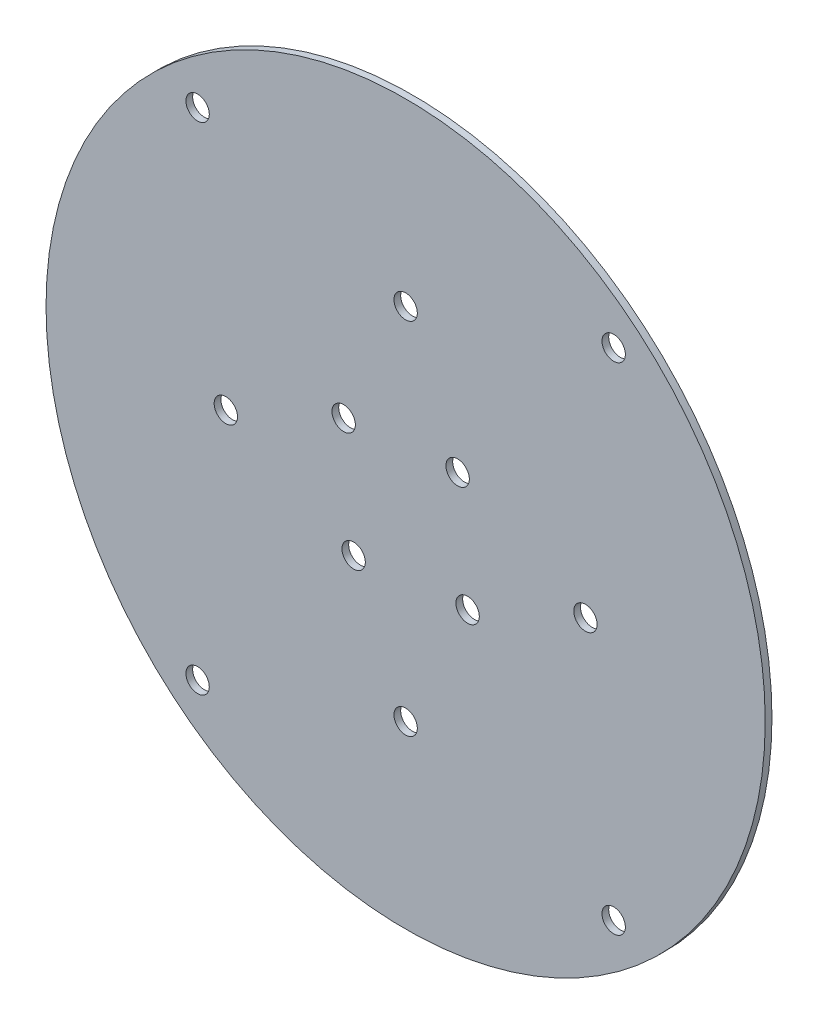
ISO-10303-21;
HEADER;
FILE_DESCRIPTION(('STEP AP214'),'2;1');
FILE_NAME('part.step','',(''),(''),'','','');
FILE_SCHEMA(('AUTOMOTIVE_DESIGN { 1 0 10303 214 1 1 1 1 }'));
ENDSEC;
DATA;
#1=APPLICATION_CONTEXT('core data for automotive mechanical design processes');
#2=APPLICATION_PROTOCOL_DEFINITION('international standard','automotive_design',2000,#1);
#3=PRODUCT_CONTEXT('',#1,'mechanical');
#4=PRODUCT('Part','Part','',(#3));
#5=PRODUCT_RELATED_PRODUCT_CATEGORY('part','',(#4));
#6=PRODUCT_DEFINITION_FORMATION('','',#4);
#7=PRODUCT_DEFINITION_CONTEXT('part definition',#1,'design');
#8=PRODUCT_DEFINITION('design','',#6,#7);
#9=PRODUCT_DEFINITION_SHAPE('','',#8);
#10=(LENGTH_UNIT() NAMED_UNIT(*) SI_UNIT(.MILLI.,.METRE.));
#11=(NAMED_UNIT(*) PLANE_ANGLE_UNIT() SI_UNIT($,.RADIAN.));
#12=(NAMED_UNIT(*) SI_UNIT($,.STERADIAN.) SOLID_ANGLE_UNIT());
#13=UNCERTAINTY_MEASURE_WITH_UNIT(LENGTH_MEASURE(1.E-05),#10,'distance_accuracy_value','');
#14=(GEOMETRIC_REPRESENTATION_CONTEXT(3) GLOBAL_UNCERTAINTY_ASSIGNED_CONTEXT((#13)) GLOBAL_UNIT_ASSIGNED_CONTEXT((#10,
#11,#12)) REPRESENTATION_CONTEXT('',''));
#15=CARTESIAN_POINT('',(0.,0.,0.));
#16=DIRECTION('',(0.,0.,1.));
#17=DIRECTION('',(1.,0.,0.));
#18=AXIS2_PLACEMENT_3D('',#15,#16,#17);
#19=CARTESIAN_POINT('',(0.,0.,1.5));
#20=DIRECTION('',(0.,0.,1.));
#21=DIRECTION('',(1.,0.,0.));
#22=AXIS2_PLACEMENT_3D('',#19,#20,#21);
#23=PLANE('',#22);
#24=CARTESIAN_POINT('',(-13.7887999761416,11.5701769743577,1.5));
#25=DIRECTION('',(0.,0.,1.));
#26=DIRECTION('',(1.,0.,0.));
#27=AXIS2_PLACEMENT_3D('',#24,#25,#26);
#28=CIRCLE('',#27,2.6);
#29=CARTESIAN_POINT('',(-11.1887999761416,11.5701769743577,1.5));
#30=VERTEX_POINT('',#29);
#31=EDGE_CURVE('E103',#30,#30,#28,.T.);
#32=ORIENTED_EDGE('',*,*,#31,.F.);
#33=EDGE_LOOP('',(#32));
#34=FACE_BOUND('',#33,.T.);
#35=CARTESIAN_POINT('',(-11.5701769743577,-13.7887999761416,1.5));
#36=DIRECTION('',(0.,0.,1.));
#37=DIRECTION('',(1.,0.,0.));
#38=AXIS2_PLACEMENT_3D('',#35,#36,#37);
#39=CIRCLE('',#38,2.6);
#40=CARTESIAN_POINT('',(-8.97017697435773,-13.7887999761416,1.5));
#41=VERTEX_POINT('',#40);
#42=EDGE_CURVE('E106',#41,#41,#39,.T.);
#43=ORIENTED_EDGE('',*,*,#42,.F.);
#44=EDGE_LOOP('',(#43));
#45=FACE_BOUND('',#44,.T.);
#46=CARTESIAN_POINT('',(13.7887999761417,-11.5701769743576,1.5));
#47=DIRECTION('',(0.,0.,1.));
#48=DIRECTION('',(1.,0.,0.));
#49=AXIS2_PLACEMENT_3D('',#46,#47,#48);
#50=CIRCLE('',#49,2.6);
#51=CARTESIAN_POINT('',(16.3887999761417,-11.5701769743576,1.5));
#52=VERTEX_POINT('',#51);
#53=EDGE_CURVE('E109',#52,#52,#50,.T.);
#54=ORIENTED_EDGE('',*,*,#53,.F.);
#55=EDGE_LOOP('',(#54));
#56=FACE_BOUND('',#55,.T.);
#57=CARTESIAN_POINT('',(11.5701769743577,13.7887999761416,1.5));
#58=DIRECTION('',(0.,0.,1.));
#59=DIRECTION('',(1.,0.,0.));
#60=AXIS2_PLACEMENT_3D('',#57,#58,#59);
#61=CIRCLE('',#60,2.6);
#62=CARTESIAN_POINT('',(14.1701769743577,13.7887999761416,1.5));
#63=VERTEX_POINT('',#62);
#64=EDGE_CURVE('E95',#63,#63,#61,.T.);
#65=ORIENTED_EDGE('',*,*,#64,.F.);
#66=EDGE_LOOP('',(#65));
#67=FACE_BOUND('',#66,.T.);
#68=CARTESIAN_POINT('',(1.69550539143106E-12,-40.,1.5));
#69=DIRECTION('',(0.,0.,1.));
#70=DIRECTION('',(1.,0.,0.));
#71=AXIS2_PLACEMENT_3D('',#68,#69,#70);
#72=CIRCLE('',#71,2.6);
#73=CARTESIAN_POINT('',(2.6000000000017,-40.,1.5));
#74=VERTEX_POINT('',#73);
#75=EDGE_CURVE('E83',#74,#74,#72,.T.);
#76=ORIENTED_EDGE('',*,*,#75,.F.);
#77=EDGE_LOOP('',(#76));
#78=FACE_BOUND('',#77,.T.);
#79=CARTESIAN_POINT('',(0.,40.,1.5));
#80=DIRECTION('',(0.,0.,1.));
#81=DIRECTION('',(1.,0.,0.));
#82=AXIS2_PLACEMENT_3D('',#79,#80,#81);
#83=CIRCLE('',#82,2.6);
#84=CARTESIAN_POINT('',(2.6,40.,1.5));
#85=VERTEX_POINT('',#84);
#86=EDGE_CURVE('E71',#85,#85,#83,.T.);
#87=ORIENTED_EDGE('',*,*,#86,.F.);
#88=EDGE_LOOP('',(#87));
#89=FACE_BOUND('',#88,.T.);
#90=CARTESIAN_POINT('',(46.280707897431,-55.1551999045663,1.5));
#91=DIRECTION('',(0.,0.,1.));
#92=DIRECTION('',(1.,0.,0.));
#93=AXIS2_PLACEMENT_3D('',#90,#91,#92);
#94=CIRCLE('',#93,2.6);
#95=CARTESIAN_POINT('',(48.880707897431,-55.1551999045663,1.5));
#96=VERTEX_POINT('',#95);
#97=EDGE_CURVE('E59',#96,#96,#94,.T.);
#98=ORIENTED_EDGE('',*,*,#97,.F.);
#99=EDGE_LOOP('',(#98));
#100=FACE_BOUND('',#99,.T.);
#101=CARTESIAN_POINT('',(-46.280707897431,55.1551999045664,1.5));
#102=DIRECTION('',(0.,0.,1.));
#103=DIRECTION('',(1.,0.,0.));
#104=AXIS2_PLACEMENT_3D('',#101,#102,#103);
#105=CIRCLE('',#104,2.6);
#106=CARTESIAN_POINT('',(-43.680707897431,55.1551999045664,1.5));
#107=VERTEX_POINT('',#106);
#108=EDGE_CURVE('E48',#107,#107,#105,.T.);
#109=ORIENTED_EDGE('',*,*,#108,.F.);
#110=EDGE_LOOP('',(#109));
#111=FACE_BOUND('',#110,.T.);
#112=CARTESIAN_POINT('',(0.,0.,1.5));
#113=DIRECTION('',(0.,0.,1.));
#114=DIRECTION('',(1.,0.,0.));
#115=AXIS2_PLACEMENT_3D('',#112,#113,#114);
#116=CIRCLE('',#115,80.);
#117=CARTESIAN_POINT('',(80.,0.,1.5));
#118=VERTEX_POINT('',#117);
#119=EDGE_CURVE('E10',#118,#118,#116,.T.);
#120=ORIENTED_EDGE('',*,*,#119,.T.);
#121=EDGE_LOOP('',(#120));
#122=FACE_BOUND('',#121,.T.);
#123=CARTESIAN_POINT('',(-46.2807078974309,-55.1551999045663,1.5));
#124=DIRECTION('',(0.,0.,1.));
#125=DIRECTION('',(1.,0.,0.));
#126=AXIS2_PLACEMENT_3D('',#123,#124,#125);
#127=CIRCLE('',#126,2.6);
#128=CARTESIAN_POINT('',(-43.6807078974309,-55.1551999045663,1.5));
#129=VERTEX_POINT('',#128);
#130=EDGE_CURVE('E53',#129,#129,#127,.T.);
#131=ORIENTED_EDGE('',*,*,#130,.F.);
#132=EDGE_LOOP('',(#131));
#133=FACE_BOUND('',#132,.T.);
#134=CARTESIAN_POINT('',(46.2807078974309,55.1551999045663,1.5));
#135=DIRECTION('',(0.,0.,1.));
#136=DIRECTION('',(1.,0.,0.));
#137=AXIS2_PLACEMENT_3D('',#134,#135,#136);
#138=CIRCLE('',#137,2.6);
#139=CARTESIAN_POINT('',(48.8807078974309,55.1551999045663,1.5));
#140=VERTEX_POINT('',#139);
#141=EDGE_CURVE('E65',#140,#140,#138,.T.);
#142=ORIENTED_EDGE('',*,*,#141,.F.);
#143=EDGE_LOOP('',(#142));
#144=FACE_BOUND('',#143,.T.);
#145=CARTESIAN_POINT('',(40.0000000000008,8.47752695715531E-13,1.5));
#146=DIRECTION('',(0.,0.,1.));
#147=DIRECTION('',(1.,0.,0.));
#148=AXIS2_PLACEMENT_3D('',#145,#146,#147);
#149=CIRCLE('',#148,2.6);
#150=CARTESIAN_POINT('',(42.6000000000008,8.47752695715531E-13,1.5));
#151=VERTEX_POINT('',#150);
#152=EDGE_CURVE('E77',#151,#151,#149,.T.);
#153=ORIENTED_EDGE('',*,*,#152,.F.);
#154=EDGE_LOOP('',(#153));
#155=FACE_BOUND('',#154,.T.);
#156=CARTESIAN_POINT('',(-39.9999999999992,-8.5265128291212E-13,1.5));
#157=DIRECTION('',(0.,0.,1.));
#158=DIRECTION('',(1.,0.,0.));
#159=AXIS2_PLACEMENT_3D('',#156,#157,#158);
#160=CIRCLE('',#159,2.6);
#161=CARTESIAN_POINT('',(-37.3999999999992,-8.5265128291212E-13,1.5));
#162=VERTEX_POINT('',#161);
#163=EDGE_CURVE('E89',#162,#162,#160,.T.);
#164=ORIENTED_EDGE('',*,*,#163,.F.);
#165=EDGE_LOOP('',(#164));
#166=FACE_BOUND('',#165,.T.);
#167=ADVANCED_FACE('F37',(#34,#45,#56,#67,#78,#89,#100,#111,#122,#133,#144,#155,#166),#23,.T.);
#168=CARTESIAN_POINT('',(0.,0.,0.));
#169=DIRECTION('',(0.,0.,1.));
#170=DIRECTION('',(1.,0.,0.));
#171=AXIS2_PLACEMENT_3D('',#168,#169,#170);
#172=PLANE('',#171);
#173=CARTESIAN_POINT('',(-13.7887999761416,11.5701769743577,0.));
#174=DIRECTION('',(0.,0.,-1.));
#175=DIRECTION('',(0.,-1.,0.));
#176=AXIS2_PLACEMENT_3D('',#173,#174,#175);
#177=CIRCLE('',#176,2.6);
#178=CARTESIAN_POINT('',(-13.7887999761416,8.97017697435768,0.));
#179=VERTEX_POINT('',#178);
#180=EDGE_CURVE('E112',#179,#179,#177,.T.);
#181=ORIENTED_EDGE('',*,*,#180,.F.);
#182=EDGE_LOOP('',(#181));
#183=FACE_BOUND('',#182,.T.);
#184=CARTESIAN_POINT('',(-11.5701769743577,-13.7887999761416,0.));
#185=DIRECTION('',(0.,0.,-1.));
#186=DIRECTION('',(1.,0.,0.));
#187=AXIS2_PLACEMENT_3D('',#184,#185,#186);
#188=CIRCLE('',#187,2.6);
#189=CARTESIAN_POINT('',(-8.97017697435773,-13.7887999761416,0.));
#190=VERTEX_POINT('',#189);
#191=EDGE_CURVE('E116',#190,#190,#188,.T.);
#192=ORIENTED_EDGE('',*,*,#191,.F.);
#193=EDGE_LOOP('',(#192));
#194=FACE_BOUND('',#193,.T.);
#195=CARTESIAN_POINT('',(13.7887999761417,-11.5701769743576,0.));
#196=DIRECTION('',(0.,0.,-1.));
#197=DIRECTION('',(0.,1.,0.));
#198=AXIS2_PLACEMENT_3D('',#195,#196,#197);
#199=CIRCLE('',#198,2.6);
#200=CARTESIAN_POINT('',(13.7887999761417,-8.97017697435758,0.));
#201=VERTEX_POINT('',#200);
#202=EDGE_CURVE('E113',#201,#201,#199,.T.);
#203=ORIENTED_EDGE('',*,*,#202,.F.);
#204=EDGE_LOOP('',(#203));
#205=FACE_BOUND('',#204,.T.);
#206=CARTESIAN_POINT('',(11.5701769743577,13.7887999761416,0.));
#207=DIRECTION('',(0.,0.,-1.));
#208=DIRECTION('',(-1.,0.,0.));
#209=AXIS2_PLACEMENT_3D('',#206,#207,#208);
#210=CIRCLE('',#209,2.6);
#211=CARTESIAN_POINT('',(8.97017697435773,13.7887999761416,0.));
#212=VERTEX_POINT('',#211);
#213=EDGE_CURVE('E100',#212,#212,#210,.T.);
#214=ORIENTED_EDGE('',*,*,#213,.F.);
#215=EDGE_LOOP('',(#214));
#216=FACE_BOUND('',#215,.T.);
#217=CARTESIAN_POINT('',(0.,0.,0.));
#218=DIRECTION('',(0.,0.,1.));
#219=DIRECTION('',(1.,0.,0.));
#220=AXIS2_PLACEMENT_3D('',#217,#218,#219);
#221=CIRCLE('',#220,80.);
#222=CARTESIAN_POINT('',(80.,0.,0.));
#223=VERTEX_POINT('',#222);
#224=EDGE_CURVE('E41',#223,#223,#221,.T.);
#225=ORIENTED_EDGE('',*,*,#224,.F.);
#226=EDGE_LOOP('',(#225));
#227=FACE_BOUND('',#226,.T.);
#228=CARTESIAN_POINT('',(-46.280707897431,55.1551999045664,0.));
#229=DIRECTION('',(0.,0.,1.));
#230=DIRECTION('',(1.,0.,0.));
#231=AXIS2_PLACEMENT_3D('',#228,#229,#230);
#232=CIRCLE('',#231,2.6);
#233=CARTESIAN_POINT('',(-43.680707897431,55.1551999045664,0.));
#234=VERTEX_POINT('',#233);
#235=EDGE_CURVE('E50',#234,#234,#232,.T.);
#236=ORIENTED_EDGE('',*,*,#235,.T.);
#237=EDGE_LOOP('',(#236));
#238=FACE_BOUND('',#237,.T.);
#239=CARTESIAN_POINT('',(-46.2807078974309,-55.1551999045663,0.));
#240=DIRECTION('',(0.,0.,1.));
#241=DIRECTION('',(1.,0.,0.));
#242=AXIS2_PLACEMENT_3D('',#239,#240,#241);
#243=CIRCLE('',#242,2.6);
#244=CARTESIAN_POINT('',(-43.6807078974309,-55.1551999045663,0.));
#245=VERTEX_POINT('',#244);
#246=EDGE_CURVE('E56',#245,#245,#243,.T.);
#247=ORIENTED_EDGE('',*,*,#246,.T.);
#248=EDGE_LOOP('',(#247));
#249=FACE_BOUND('',#248,.T.);
#250=CARTESIAN_POINT('',(46.280707897431,-55.1551999045663,0.));
#251=DIRECTION('',(0.,0.,1.));
#252=DIRECTION('',(1.,0.,0.));
#253=AXIS2_PLACEMENT_3D('',#250,#251,#252);
#254=CIRCLE('',#253,2.6);
#255=CARTESIAN_POINT('',(48.880707897431,-55.1551999045663,0.));
#256=VERTEX_POINT('',#255);
#257=EDGE_CURVE('E62',#256,#256,#254,.T.);
#258=ORIENTED_EDGE('',*,*,#257,.T.);
#259=EDGE_LOOP('',(#258));
#260=FACE_BOUND('',#259,.T.);
#261=CARTESIAN_POINT('',(46.2807078974309,55.1551999045663,0.));
#262=DIRECTION('',(0.,0.,1.));
#263=DIRECTION('',(1.,0.,0.));
#264=AXIS2_PLACEMENT_3D('',#261,#262,#263);
#265=CIRCLE('',#264,2.6);
#266=CARTESIAN_POINT('',(48.8807078974309,55.1551999045663,0.));
#267=VERTEX_POINT('',#266);
#268=EDGE_CURVE('E68',#267,#267,#265,.T.);
#269=ORIENTED_EDGE('',*,*,#268,.T.);
#270=EDGE_LOOP('',(#269));
#271=FACE_BOUND('',#270,.T.);
#272=CARTESIAN_POINT('',(0.,40.,0.));
#273=DIRECTION('',(0.,0.,1.));
#274=DIRECTION('',(1.,0.,0.));
#275=AXIS2_PLACEMENT_3D('',#272,#273,#274);
#276=CIRCLE('',#275,2.6);
#277=CARTESIAN_POINT('',(2.6,40.,0.));
#278=VERTEX_POINT('',#277);
#279=EDGE_CURVE('E74',#278,#278,#276,.T.);
#280=ORIENTED_EDGE('',*,*,#279,.T.);
#281=EDGE_LOOP('',(#280));
#282=FACE_BOUND('',#281,.T.);
#283=CARTESIAN_POINT('',(40.0000000000008,8.47752695715531E-13,0.));
#284=DIRECTION('',(0.,0.,1.));
#285=DIRECTION('',(1.,0.,0.));
#286=AXIS2_PLACEMENT_3D('',#283,#284,#285);
#287=CIRCLE('',#286,2.6);
#288=CARTESIAN_POINT('',(42.6000000000008,8.47752695715531E-13,0.));
#289=VERTEX_POINT('',#288);
#290=EDGE_CURVE('E80',#289,#289,#287,.T.);
#291=ORIENTED_EDGE('',*,*,#290,.T.);
#292=EDGE_LOOP('',(#291));
#293=FACE_BOUND('',#292,.T.);
#294=CARTESIAN_POINT('',(1.69550539143106E-12,-40.,0.));
#295=DIRECTION('',(0.,0.,1.));
#296=DIRECTION('',(1.,0.,0.));
#297=AXIS2_PLACEMENT_3D('',#294,#295,#296);
#298=CIRCLE('',#297,2.6);
#299=CARTESIAN_POINT('',(2.6000000000017,-40.,0.));
#300=VERTEX_POINT('',#299);
#301=EDGE_CURVE('E86',#300,#300,#298,.T.);
#302=ORIENTED_EDGE('',*,*,#301,.T.);
#303=EDGE_LOOP('',(#302));
#304=FACE_BOUND('',#303,.T.);
#305=CARTESIAN_POINT('',(-39.9999999999992,-8.5265128291212E-13,0.));
#306=DIRECTION('',(0.,0.,1.));
#307=DIRECTION('',(1.,0.,0.));
#308=AXIS2_PLACEMENT_3D('',#305,#306,#307);
#309=CIRCLE('',#308,2.6);
#310=CARTESIAN_POINT('',(-37.3999999999992,-8.5265128291212E-13,0.));
#311=VERTEX_POINT('',#310);
#312=EDGE_CURVE('E92',#311,#311,#309,.T.);
#313=ORIENTED_EDGE('',*,*,#312,.T.);
#314=EDGE_LOOP('',(#313));
#315=FACE_BOUND('',#314,.T.);
#316=ADVANCED_FACE('F124',(#183,#194,#205,#216,#227,#238,#249,#260,#271,#282,#293,#304,#315),
#172,.F.);
#317=CARTESIAN_POINT('',(0.,0.,1.5));
#318=DIRECTION('',(0.,0.,-1.));
#319=DIRECTION('',(-1.,0.,0.));
#320=AXIS2_PLACEMENT_3D('',#317,#318,#319);
#321=CYLINDRICAL_SURFACE('',#320,80.);
#322=ORIENTED_EDGE('',*,*,#119,.F.);
#323=EDGE_LOOP('',(#322));
#324=FACE_BOUND('',#323,.T.);
#325=ORIENTED_EDGE('',*,*,#224,.T.);
#326=EDGE_LOOP('',(#325));
#327=FACE_BOUND('',#326,.T.);
#328=ADVANCED_FACE('F39',(#324,#327),#321,.T.);
#329=CARTESIAN_POINT('',(-46.280707897431,55.1551999045664,1.5));
#330=DIRECTION('',(0.,0.,-1.));
#331=DIRECTION('',(-1.,0.,0.));
#332=AXIS2_PLACEMENT_3D('',#329,#330,#331);
#333=CYLINDRICAL_SURFACE('',#332,2.6);
#334=ORIENTED_EDGE('',*,*,#108,.T.);
#335=EDGE_LOOP('',(#334));
#336=FACE_BOUND('',#335,.T.);
#337=ORIENTED_EDGE('',*,*,#235,.F.);
#338=EDGE_LOOP('',(#337));
#339=FACE_BOUND('',#338,.T.);
#340=ADVANCED_FACE('F175',(#336,#339),#333,.F.);
#341=CARTESIAN_POINT('',(-46.2807078974309,-55.1551999045663,1.5));
#342=DIRECTION('',(0.,0.,-1.));
#343=DIRECTION('',(-1.,0.,0.));
#344=AXIS2_PLACEMENT_3D('',#341,#342,#343);
#345=CYLINDRICAL_SURFACE('',#344,2.6);
#346=ORIENTED_EDGE('',*,*,#130,.T.);
#347=EDGE_LOOP('',(#346));
#348=FACE_BOUND('',#347,.T.);
#349=ORIENTED_EDGE('',*,*,#246,.F.);
#350=EDGE_LOOP('',(#349));
#351=FACE_BOUND('',#350,.T.);
#352=ADVANCED_FACE('F178',(#348,#351),#345,.F.);
#353=CARTESIAN_POINT('',(46.280707897431,-55.1551999045663,1.5));
#354=DIRECTION('',(0.,0.,-1.));
#355=DIRECTION('',(-1.,0.,0.));
#356=AXIS2_PLACEMENT_3D('',#353,#354,#355);
#357=CYLINDRICAL_SURFACE('',#356,2.6);
#358=ORIENTED_EDGE('',*,*,#97,.T.);
#359=EDGE_LOOP('',(#358));
#360=FACE_BOUND('',#359,.T.);
#361=ORIENTED_EDGE('',*,*,#257,.F.);
#362=EDGE_LOOP('',(#361));
#363=FACE_BOUND('',#362,.T.);
#364=ADVANCED_FACE('F182',(#360,#363),#357,.F.);
#365=CARTESIAN_POINT('',(46.2807078974309,55.1551999045663,1.5));
#366=DIRECTION('',(0.,0.,-1.));
#367=DIRECTION('',(-1.,0.,0.));
#368=AXIS2_PLACEMENT_3D('',#365,#366,#367);
#369=CYLINDRICAL_SURFACE('',#368,2.6);
#370=ORIENTED_EDGE('',*,*,#141,.T.);
#371=EDGE_LOOP('',(#370));
#372=FACE_BOUND('',#371,.T.);
#373=ORIENTED_EDGE('',*,*,#268,.F.);
#374=EDGE_LOOP('',(#373));
#375=FACE_BOUND('',#374,.T.);
#376=ADVANCED_FACE('F186',(#372,#375),#369,.F.);
#377=CARTESIAN_POINT('',(0.,40.,1.5));
#378=DIRECTION('',(0.,0.,-1.));
#379=DIRECTION('',(-1.,0.,0.));
#380=AXIS2_PLACEMENT_3D('',#377,#378,#379);
#381=CYLINDRICAL_SURFACE('',#380,2.6);
#382=ORIENTED_EDGE('',*,*,#86,.T.);
#383=EDGE_LOOP('',(#382));
#384=FACE_BOUND('',#383,.T.);
#385=ORIENTED_EDGE('',*,*,#279,.F.);
#386=EDGE_LOOP('',(#385));
#387=FACE_BOUND('',#386,.T.);
#388=ADVANCED_FACE('F190',(#384,#387),#381,.F.);
#389=CARTESIAN_POINT('',(40.0000000000008,8.47752695715531E-13,1.5));
#390=DIRECTION('',(0.,0.,-1.));
#391=DIRECTION('',(-1.,0.,0.));
#392=AXIS2_PLACEMENT_3D('',#389,#390,#391);
#393=CYLINDRICAL_SURFACE('',#392,2.6);
#394=ORIENTED_EDGE('',*,*,#152,.T.);
#395=EDGE_LOOP('',(#394));
#396=FACE_BOUND('',#395,.T.);
#397=ORIENTED_EDGE('',*,*,#290,.F.);
#398=EDGE_LOOP('',(#397));
#399=FACE_BOUND('',#398,.T.);
#400=ADVANCED_FACE('F164',(#396,#399),#393,.F.);
#401=CARTESIAN_POINT('',(1.69550539143106E-12,-40.,1.5));
#402=DIRECTION('',(0.,0.,-1.));
#403=DIRECTION('',(-1.,0.,0.));
#404=AXIS2_PLACEMENT_3D('',#401,#402,#403);
#405=CYLINDRICAL_SURFACE('',#404,2.6);
#406=ORIENTED_EDGE('',*,*,#75,.T.);
#407=EDGE_LOOP('',(#406));
#408=FACE_BOUND('',#407,.T.);
#409=ORIENTED_EDGE('',*,*,#301,.F.);
#410=EDGE_LOOP('',(#409));
#411=FACE_BOUND('',#410,.T.);
#412=ADVANCED_FACE('F154',(#408,#411),#405,.F.);
#413=CARTESIAN_POINT('',(-39.9999999999992,-8.5265128291212E-13,1.5));
#414=DIRECTION('',(0.,0.,-1.));
#415=DIRECTION('',(-1.,0.,0.));
#416=AXIS2_PLACEMENT_3D('',#413,#414,#415);
#417=CYLINDRICAL_SURFACE('',#416,2.6);
#418=ORIENTED_EDGE('',*,*,#163,.T.);
#419=EDGE_LOOP('',(#418));
#420=FACE_BOUND('',#419,.T.);
#421=ORIENTED_EDGE('',*,*,#312,.F.);
#422=EDGE_LOOP('',(#421));
#423=FACE_BOUND('',#422,.T.);
#424=ADVANCED_FACE('F151',(#420,#423),#417,.F.);
#425=CARTESIAN_POINT('',(11.5701769743577,13.7887999761416,10.));
#426=DIRECTION('',(0.,0.,-1.));
#427=DIRECTION('',(-1.,0.,0.));
#428=AXIS2_PLACEMENT_3D('',#425,#426,#427);
#429=CYLINDRICAL_SURFACE('',#428,2.6);
#430=ORIENTED_EDGE('',*,*,#64,.T.);
#431=EDGE_LOOP('',(#430));
#432=FACE_BOUND('',#431,.T.);
#433=ORIENTED_EDGE('',*,*,#213,.T.);
#434=EDGE_LOOP('',(#433));
#435=FACE_BOUND('',#434,.T.);
#436=ADVANCED_FACE('F153',(#432,#435),#429,.F.);
#437=CARTESIAN_POINT('',(13.7887999761417,-11.5701769743576,10.));
#438=DIRECTION('',(0.,0.,-1.));
#439=DIRECTION('',(-1.,0.,0.));
#440=AXIS2_PLACEMENT_3D('',#437,#438,#439);
#441=CYLINDRICAL_SURFACE('',#440,2.6);
#442=ORIENTED_EDGE('',*,*,#53,.T.);
#443=EDGE_LOOP('',(#442));
#444=FACE_BOUND('',#443,.T.);
#445=ORIENTED_EDGE('',*,*,#202,.T.);
#446=EDGE_LOOP('',(#445));
#447=FACE_BOUND('',#446,.T.);
#448=ADVANCED_FACE('F161',(#444,#447),#441,.F.);
#449=CARTESIAN_POINT('',(-11.5701769743577,-13.7887999761416,10.));
#450=DIRECTION('',(0.,0.,-1.));
#451=DIRECTION('',(-1.,0.,0.));
#452=AXIS2_PLACEMENT_3D('',#449,#450,#451);
#453=CYLINDRICAL_SURFACE('',#452,2.6);
#454=ORIENTED_EDGE('',*,*,#42,.T.);
#455=EDGE_LOOP('',(#454));
#456=FACE_BOUND('',#455,.T.);
#457=ORIENTED_EDGE('',*,*,#191,.T.);
#458=EDGE_LOOP('',(#457));
#459=FACE_BOUND('',#458,.T.);
#460=ADVANCED_FACE('F241',(#456,#459),#453,.F.);
#461=CARTESIAN_POINT('',(-13.7887999761416,11.5701769743577,10.));
#462=DIRECTION('',(0.,0.,-1.));
#463=DIRECTION('',(-1.,0.,0.));
#464=AXIS2_PLACEMENT_3D('',#461,#462,#463);
#465=CYLINDRICAL_SURFACE('',#464,2.6);
#466=ORIENTED_EDGE('',*,*,#31,.T.);
#467=EDGE_LOOP('',(#466));
#468=FACE_BOUND('',#467,.T.);
#469=ORIENTED_EDGE('',*,*,#180,.T.);
#470=EDGE_LOOP('',(#469));
#471=FACE_BOUND('',#470,.T.);
#472=ADVANCED_FACE('F122',(#468,#471),#465,.F.);
#473=CLOSED_SHELL('',(#167,#316,#328,#340,#352,#364,#376,#388,#400,#412,#424,#436,#448,#460,#472));
#474=MANIFOLD_SOLID_BREP('B2',#473);
#475=ADVANCED_BREP_SHAPE_REPRESENTATION('',(#18,#474),#14);
#476=SHAPE_DEFINITION_REPRESENTATION(#9,#475);
ENDSEC;
END-ISO-10303-21;
